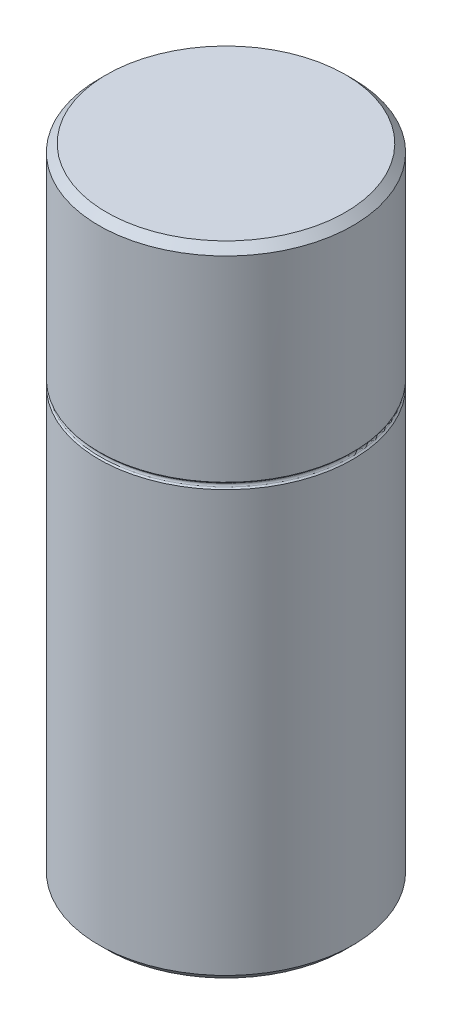
ISO-10303-21;
HEADER;
FILE_DESCRIPTION(('STEP AP214'),'2;1');
FILE_NAME('part.step','',(''),(''),'','','');
FILE_SCHEMA(('AUTOMOTIVE_DESIGN { 1 0 10303 214 1 1 1 1 }'));
ENDSEC;
DATA;
#1=APPLICATION_CONTEXT('core data for automotive mechanical design processes');
#2=APPLICATION_PROTOCOL_DEFINITION('international standard','automotive_design',2000,#1);
#3=PRODUCT_CONTEXT('',#1,'mechanical');
#4=PRODUCT('Part','Part','',(#3));
#5=PRODUCT_RELATED_PRODUCT_CATEGORY('part','',(#4));
#6=PRODUCT_DEFINITION_FORMATION('','',#4);
#7=PRODUCT_DEFINITION_CONTEXT('part definition',#1,'design');
#8=PRODUCT_DEFINITION('design','',#6,#7);
#9=PRODUCT_DEFINITION_SHAPE('','',#8);
#10=(LENGTH_UNIT() NAMED_UNIT(*) SI_UNIT(.MILLI.,.METRE.));
#11=(NAMED_UNIT(*) PLANE_ANGLE_UNIT() SI_UNIT($,.RADIAN.));
#12=(NAMED_UNIT(*) SI_UNIT($,.STERADIAN.) SOLID_ANGLE_UNIT());
#13=UNCERTAINTY_MEASURE_WITH_UNIT(LENGTH_MEASURE(1.E-05),#10,'distance_accuracy_value','');
#14=(GEOMETRIC_REPRESENTATION_CONTEXT(3) GLOBAL_UNCERTAINTY_ASSIGNED_CONTEXT((#13)) GLOBAL_UNIT_ASSIGNED_CONTEXT((#10,
#11,#12)) REPRESENTATION_CONTEXT('',''));
#15=CARTESIAN_POINT('',(0.,0.,0.));
#16=DIRECTION('',(0.,0.,1.));
#17=DIRECTION('',(1.,0.,0.));
#18=AXIS2_PLACEMENT_3D('',#15,#16,#17);
#19=CARTESIAN_POINT('',(0.,0.,0.));
#20=DIRECTION('',(0.,-1.,0.));
#21=DIRECTION('',(0.,0.,-1.));
#22=AXIS2_PLACEMENT_3D('',#19,#20,#21);
#23=CYLINDRICAL_SURFACE('',#22,6.3881);
#24=CARTESIAN_POINT('',(0.,0.,0.));
#25=DIRECTION('',(0.,-1.,0.));
#26=DIRECTION('',(0.,0.,-1.));
#27=AXIS2_PLACEMENT_3D('',#24,#25,#26);
#28=CIRCLE('',#27,6.3881);
#29=CARTESIAN_POINT('',(0.,0.,-6.3881));
#30=VERTEX_POINT('',#29);
#31=EDGE_CURVE('E10',#30,#30,#28,.T.);
#32=ORIENTED_EDGE('',*,*,#31,.T.);
#33=EDGE_LOOP('',(#32));
#34=FACE_BOUND('',#33,.T.);
#35=CARTESIAN_POINT('',(0.,4.572,0.));
#36=DIRECTION('',(0.,-1.,0.));
#37=DIRECTION('',(0.,0.,-1.));
#38=AXIS2_PLACEMENT_3D('',#35,#36,#37);
#39=CIRCLE('',#38,6.3881);
#40=CARTESIAN_POINT('',(0.,4.572,-6.3881));
#41=VERTEX_POINT('',#40);
#42=EDGE_CURVE('E53',#41,#41,#39,.T.);
#43=ORIENTED_EDGE('',*,*,#42,.F.);
#44=EDGE_LOOP('',(#43));
#45=FACE_BOUND('',#44,.T.);
#46=ADVANCED_FACE('F32',(#34,#45),#23,.F.);
#47=CARTESIAN_POINT('',(11.8745,0.,0.));
#48=DIRECTION('',(0.,-1.,0.));
#49=DIRECTION('',(0.,0.,-1.));
#50=AXIS2_PLACEMENT_3D('',#47,#48,#49);
#51=PLANE('',#50);
#52=CARTESIAN_POINT('',(0.,0.,0.));
#53=DIRECTION('',(0.,-1.,0.));
#54=DIRECTION('',(0.,0.,-1.));
#55=AXIS2_PLACEMENT_3D('',#52,#53,#54);
#56=CIRCLE('',#55,11.8745);
#57=CARTESIAN_POINT('',(0.,0.,-11.8745));
#58=VERTEX_POINT('',#57);
#59=EDGE_CURVE('E39',#58,#58,#56,.T.);
#60=ORIENTED_EDGE('',*,*,#59,.T.);
#61=EDGE_LOOP('',(#60));
#62=FACE_BOUND('',#61,.T.);
#63=ORIENTED_EDGE('',*,*,#31,.F.);
#64=EDGE_LOOP('',(#63));
#65=FACE_BOUND('',#64,.T.);
#66=ADVANCED_FACE('F91',(#62,#65),#51,.T.);
#67=CARTESIAN_POINT('',(0.,0.,0.));
#68=DIRECTION('',(0.,1.,0.));
#69=DIRECTION('',(0.,0.,1.));
#70=AXIS2_PLACEMENT_3D('',#67,#68,#69);
#71=CONICAL_SURFACE('',#70,11.8745,0.785398163397449);
#72=CARTESIAN_POINT('',(0.,0.762,0.));
#73=DIRECTION('',(0.,-1.,0.));
#74=DIRECTION('',(0.,0.,-1.));
#75=AXIS2_PLACEMENT_3D('',#72,#73,#74);
#76=CIRCLE('',#75,12.6365);
#77=CARTESIAN_POINT('',(0.,0.762,-12.6365));
#78=VERTEX_POINT('',#77);
#79=EDGE_CURVE('E44',#78,#78,#76,.T.);
#80=ORIENTED_EDGE('',*,*,#79,.T.);
#81=EDGE_LOOP('',(#80));
#82=FACE_BOUND('',#81,.T.);
#83=ORIENTED_EDGE('',*,*,#59,.F.);
#84=EDGE_LOOP('',(#83));
#85=FACE_BOUND('',#84,.T.);
#86=ADVANCED_FACE('F75',(#82,#85),#71,.T.);
#87=CARTESIAN_POINT('',(0.,0.,0.));
#88=DIRECTION('',(0.,-1.,0.));
#89=DIRECTION('',(0.,0.,-1.));
#90=AXIS2_PLACEMENT_3D('',#87,#88,#89);
#91=CYLINDRICAL_SURFACE('',#90,12.6365);
#92=CARTESIAN_POINT('',(0.,42.6085,0.));
#93=DIRECTION('',(0.,-1.,0.));
#94=DIRECTION('',(0.,0.,-1.));
#95=AXIS2_PLACEMENT_3D('',#92,#93,#94);
#96=CIRCLE('',#95,12.6365);
#97=CARTESIAN_POINT('',(0.,42.6085,-12.6365));
#98=VERTEX_POINT('',#97);
#99=EDGE_CURVE('E47',#98,#98,#96,.F.);
#100=ORIENTED_EDGE('',*,*,#99,.F.);
#101=EDGE_LOOP('',(#100));
#102=FACE_BOUND('',#101,.T.);
#103=ORIENTED_EDGE('',*,*,#79,.F.);
#104=EDGE_LOOP('',(#103));
#105=FACE_BOUND('',#104,.T.);
#106=ADVANCED_FACE('F78',(#102,#105),#91,.T.);
#107=CARTESIAN_POINT('',(6.1341,4.826,0.));
#108=DIRECTION('',(0.,-1.,0.));
#109=DIRECTION('',(0.,0.,-1.));
#110=AXIS2_PLACEMENT_3D('',#107,#108,#109);
#111=PLANE('',#110);
#112=CARTESIAN_POINT('',(0.,4.826,0.));
#113=DIRECTION('',(0.,-1.,0.));
#114=DIRECTION('',(0.,0.,-1.));
#115=AXIS2_PLACEMENT_3D('',#112,#113,#114);
#116=CIRCLE('',#115,6.1341);
#117=CARTESIAN_POINT('',(0.,4.826,-6.1341));
#118=VERTEX_POINT('',#117);
#119=EDGE_CURVE('E64',#118,#118,#116,.T.);
#120=ORIENTED_EDGE('',*,*,#119,.T.);
#121=EDGE_LOOP('',(#120));
#122=FACE_BOUND('',#121,.T.);
#123=ADVANCED_FACE('F80',(#122),#111,.T.);
#124=CARTESIAN_POINT('',(0.,4.826,0.));
#125=DIRECTION('',(0.,-1.,0.));
#126=DIRECTION('',(0.,0.,-1.));
#127=AXIS2_PLACEMENT_3D('',#124,#125,#126);
#128=CONICAL_SURFACE('',#127,6.1341,0.785398163397448);
#129=ORIENTED_EDGE('',*,*,#42,.T.);
#130=EDGE_LOOP('',(#129));
#131=FACE_BOUND('',#130,.T.);
#132=ORIENTED_EDGE('',*,*,#119,.F.);
#133=EDGE_LOOP('',(#132));
#134=FACE_BOUND('',#133,.T.);
#135=ADVANCED_FACE('F88',(#131,#134),#128,.F.);
#136=CARTESIAN_POINT('',(0.,43.307,0.));
#137=DIRECTION('',(0.,1.,0.));
#138=DIRECTION('',(0.,0.,1.));
#139=AXIS2_PLACEMENT_3D('',#136,#137,#138);
#140=CONICAL_SURFACE('',#139,12.7,0.785398163397448);
#141=CARTESIAN_POINT('',(0.,43.2435,0.));
#142=DIRECTION('',(0.,1.,0.));
#143=DIRECTION('',(0.,0.,1.));
#144=AXIS2_PLACEMENT_3D('',#141,#142,#143);
#145=CIRCLE('',#144,12.6365);
#146=CARTESIAN_POINT('',(0.,43.2435,12.6365));
#147=VERTEX_POINT('',#146);
#148=EDGE_CURVE('E35',#147,#147,#145,.F.);
#149=ORIENTED_EDGE('',*,*,#148,.T.);
#150=EDGE_LOOP('',(#149));
#151=FACE_BOUND('',#150,.T.);
#152=CARTESIAN_POINT('',(0.,43.1056051224214,0.));
#153=DIRECTION('',(0.,-1.,0.));
#154=DIRECTION('',(0.,0.,-1.));
#155=AXIS2_PLACEMENT_3D('',#152,#153,#154);
#156=CIRCLE('',#155,12.4986051224214);
#157=CARTESIAN_POINT('',(0.,43.1056051224214,-12.4986051224214));
#158=VERTEX_POINT('',#157);
#159=EDGE_CURVE('E55',#158,#158,#156,.T.);
#160=ORIENTED_EDGE('',*,*,#159,.F.);
#161=EDGE_LOOP('',(#160));
#162=FACE_BOUND('',#161,.T.);
#163=ADVANCED_FACE('F107',(#151,#162),#140,.T.);
#164=CARTESIAN_POINT('',(0.,42.7463948775786,0.));
#165=DIRECTION('',(0.,-1.,0.));
#166=DIRECTION('',(0.,0.,-1.));
#167=AXIS2_PLACEMENT_3D('',#164,#165,#166);
#168=CONICAL_SURFACE('',#167,12.4986051224214,0.785398163397448);
#169=ORIENTED_EDGE('',*,*,#99,.T.);
#170=EDGE_LOOP('',(#169));
#171=FACE_BOUND('',#170,.T.);
#172=CARTESIAN_POINT('',(0.,42.7463948775786,0.));
#173=DIRECTION('',(0.,-1.,0.));
#174=DIRECTION('',(0.,0.,-1.));
#175=AXIS2_PLACEMENT_3D('',#172,#173,#174);
#176=CIRCLE('',#175,12.4986051224214);
#177=CARTESIAN_POINT('',(0.,42.7463948775786,-12.4986051224214));
#178=VERTEX_POINT('',#177);
#179=EDGE_CURVE('E49',#178,#178,#176,.T.);
#180=ORIENTED_EDGE('',*,*,#179,.T.);
#181=EDGE_LOOP('',(#180));
#182=FACE_BOUND('',#181,.T.);
#183=ADVANCED_FACE('F113',(#171,#182),#168,.T.);
#184=CARTESIAN_POINT('',(0.,42.926,0.));
#185=DIRECTION('',(0.,-1.,0.));
#186=DIRECTION('',(0.,0.,-1.));
#187=AXIS2_PLACEMENT_3D('',#184,#185,#186);
#188=TOROIDAL_SURFACE('',#187,12.6782102448428,0.254);
#189=ORIENTED_EDGE('',*,*,#179,.F.);
#190=EDGE_LOOP('',(#189));
#191=FACE_BOUND('',#190,.T.);
#192=ORIENTED_EDGE('',*,*,#159,.T.);
#193=EDGE_LOOP('',(#192));
#194=FACE_BOUND('',#193,.T.);
#195=ADVANCED_FACE('F120',(#191,#194),#188,.F.);
#196=CARTESIAN_POINT('',(11.8745,63.5,0.));
#197=DIRECTION('',(0.,1.,0.));
#198=DIRECTION('',(0.,0.,1.));
#199=AXIS2_PLACEMENT_3D('',#196,#197,#198);
#200=PLANE('',#199);
#201=CARTESIAN_POINT('',(0.,63.5,0.));
#202=DIRECTION('',(0.,-1.,0.));
#203=DIRECTION('',(0.,0.,-1.));
#204=AXIS2_PLACEMENT_3D('',#201,#202,#203);
#205=CIRCLE('',#204,11.8745);
#206=CARTESIAN_POINT('',(0.,63.5,-11.8745));
#207=VERTEX_POINT('',#206);
#208=EDGE_CURVE('E67',#207,#207,#205,.T.);
#209=ORIENTED_EDGE('',*,*,#208,.F.);
#210=EDGE_LOOP('',(#209));
#211=FACE_BOUND('',#210,.T.);
#212=ADVANCED_FACE('F118',(#211),#200,.T.);
#213=CARTESIAN_POINT('',(0.,62.738,0.));
#214=DIRECTION('',(0.,-1.,0.));
#215=DIRECTION('',(0.,0.,-1.));
#216=AXIS2_PLACEMENT_3D('',#213,#214,#215);
#217=CONICAL_SURFACE('',#216,12.6365,0.78539816339745);
#218=ORIENTED_EDGE('',*,*,#208,.T.);
#219=EDGE_LOOP('',(#218));
#220=FACE_BOUND('',#219,.T.);
#221=CARTESIAN_POINT('',(0.,62.738,0.));
#222=DIRECTION('',(0.,-1.,0.));
#223=DIRECTION('',(0.,0.,-1.));
#224=AXIS2_PLACEMENT_3D('',#221,#222,#223);
#225=CIRCLE('',#224,12.6365);
#226=CARTESIAN_POINT('',(0.,62.738,-12.6365));
#227=VERTEX_POINT('',#226);
#228=EDGE_CURVE('E70',#227,#227,#225,.T.);
#229=ORIENTED_EDGE('',*,*,#228,.F.);
#230=EDGE_LOOP('',(#229));
#231=FACE_BOUND('',#230,.T.);
#232=ADVANCED_FACE('F95',(#220,#231),#217,.T.);
#233=ORIENTED_EDGE('',*,*,#148,.F.);
#234=EDGE_LOOP('',(#233));
#235=FACE_BOUND('',#234,.T.);
#236=ORIENTED_EDGE('',*,*,#228,.T.);
#237=EDGE_LOOP('',(#236));
#238=FACE_BOUND('',#237,.T.);
#239=ADVANCED_FACE('F83',(#235,#238),#91,.T.);
#240=CLOSED_SHELL('',(#46,#66,#86,#106,#123,#135,#163,#183,#195,#212,#232,#239));
#241=MANIFOLD_SOLID_BREP('B2',#240);
#242=ADVANCED_BREP_SHAPE_REPRESENTATION('',(#18,#241),#14);
#243=SHAPE_DEFINITION_REPRESENTATION(#9,#242);
ENDSEC;
END-ISO-10303-21;
